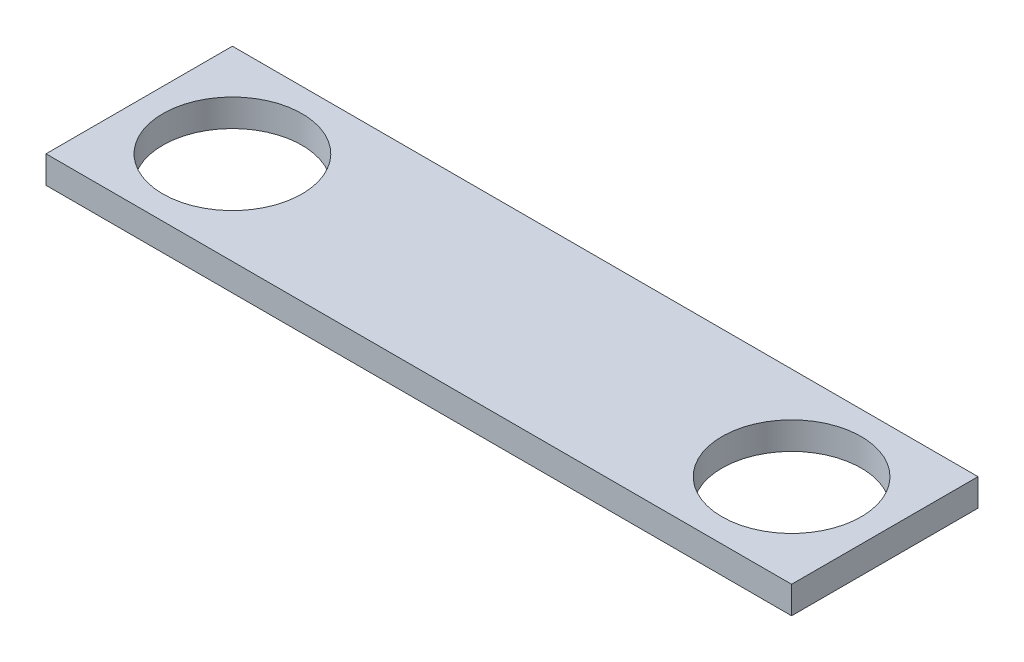
ISO-10303-21;
HEADER;
FILE_DESCRIPTION(('STEP AP214'),'2;1');
FILE_NAME('part.step','',(''),(''),'','','');
FILE_SCHEMA(('AUTOMOTIVE_DESIGN { 1 0 10303 214 1 1 1 1 }'));
ENDSEC;
DATA;
#1=APPLICATION_CONTEXT('core data for automotive mechanical design processes');
#2=APPLICATION_PROTOCOL_DEFINITION('international standard','automotive_design',2000,#1);
#3=PRODUCT_CONTEXT('',#1,'mechanical');
#4=PRODUCT('Part','Part','',(#3));
#5=PRODUCT_RELATED_PRODUCT_CATEGORY('part','',(#4));
#6=PRODUCT_DEFINITION_FORMATION('','',#4);
#7=PRODUCT_DEFINITION_CONTEXT('part definition',#1,'design');
#8=PRODUCT_DEFINITION('design','',#6,#7);
#9=PRODUCT_DEFINITION_SHAPE('','',#8);
#10=(LENGTH_UNIT() NAMED_UNIT(*) SI_UNIT(.MILLI.,.METRE.));
#11=(NAMED_UNIT(*) PLANE_ANGLE_UNIT() SI_UNIT($,.RADIAN.));
#12=(NAMED_UNIT(*) SI_UNIT($,.STERADIAN.) SOLID_ANGLE_UNIT());
#13=UNCERTAINTY_MEASURE_WITH_UNIT(LENGTH_MEASURE(1.E-05),#10,'distance_accuracy_value','');
#14=(GEOMETRIC_REPRESENTATION_CONTEXT(3) GLOBAL_UNCERTAINTY_ASSIGNED_CONTEXT((#13)) GLOBAL_UNIT_ASSIGNED_CONTEXT((#10,
#11,#12)) REPRESENTATION_CONTEXT('',''));
#15=CARTESIAN_POINT('',(0.,0.,0.));
#16=DIRECTION('',(0.,0.,1.));
#17=DIRECTION('',(1.,0.,0.));
#18=AXIS2_PLACEMENT_3D('',#15,#16,#17);
#19=CARTESIAN_POINT('',(0.,5.588,0.));
#20=DIRECTION('',(1.,0.,0.));
#21=DIRECTION('',(0.,0.,-1.));
#22=AXIS2_PLACEMENT_3D('',#19,#20,#21);
#23=PLANE('',#22);
#24=DIRECTION('',(0.,0.,1.));
#25=VECTOR('',#24,1.);
#26=CARTESIAN_POINT('',(0.,0.,0.));
#27=LINE('',#26,#25);
#28=CARTESIAN_POINT('',(0.,0.,-38.1));
#29=VERTEX_POINT('',#28);
#30=CARTESIAN_POINT('',(0.,0.,0.));
#31=VERTEX_POINT('',#30);
#32=EDGE_CURVE('E98',#29,#31,#27,.T.);
#33=ORIENTED_EDGE('',*,*,#32,.T.);
#34=DIRECTION('',(0.,-1.,0.));
#35=VECTOR('',#34,1.);
#36=CARTESIAN_POINT('',(0.,5.588,0.));
#37=LINE('',#36,#35);
#38=CARTESIAN_POINT('',(0.,5.588,0.));
#39=VERTEX_POINT('',#38);
#40=EDGE_CURVE('E11',#39,#31,#37,.T.);
#41=ORIENTED_EDGE('',*,*,#40,.F.);
#42=DIRECTION('',(0.,0.,1.));
#43=VECTOR('',#42,1.);
#44=CARTESIAN_POINT('',(0.,5.588,0.));
#45=LINE('',#44,#43);
#46=CARTESIAN_POINT('',(0.,5.588,-38.1));
#47=VERTEX_POINT('',#46);
#48=EDGE_CURVE('E86',#47,#39,#45,.T.);
#49=ORIENTED_EDGE('',*,*,#48,.F.);
#50=DIRECTION('',(0.,-1.,0.));
#51=VECTOR('',#50,1.);
#52=CARTESIAN_POINT('',(0.,5.588,-38.1));
#53=LINE('',#52,#51);
#54=EDGE_CURVE('E94',#47,#29,#53,.T.);
#55=ORIENTED_EDGE('',*,*,#54,.T.);
#56=EDGE_LOOP('',(#33,#41,#49,#55));
#57=FACE_BOUND('',#56,.T.);
#58=ADVANCED_FACE('F35',(#57),#23,.F.);
#59=CARTESIAN_POINT('',(0.,5.588,0.));
#60=DIRECTION('',(0.,0.,-1.));
#61=DIRECTION('',(-1.,0.,0.));
#62=AXIS2_PLACEMENT_3D('',#59,#60,#61);
#63=PLANE('',#62);
#64=DIRECTION('',(1.,0.,0.));
#65=VECTOR('',#64,1.);
#66=CARTESIAN_POINT('',(0.,0.,0.));
#67=LINE('',#66,#65);
#68=CARTESIAN_POINT('',(152.4,0.,0.));
#69=VERTEX_POINT('',#68);
#70=EDGE_CURVE('E90',#31,#69,#67,.T.);
#71=ORIENTED_EDGE('',*,*,#70,.T.);
#72=DIRECTION('',(0.,-1.,0.));
#73=VECTOR('',#72,1.);
#74=CARTESIAN_POINT('',(152.4,5.588,0.));
#75=LINE('',#74,#73);
#76=CARTESIAN_POINT('',(152.4,5.588,0.));
#77=VERTEX_POINT('',#76);
#78=EDGE_CURVE('E43',#77,#69,#75,.T.);
#79=ORIENTED_EDGE('',*,*,#78,.F.);
#80=DIRECTION('',(1.,0.,0.));
#81=VECTOR('',#80,1.);
#82=CARTESIAN_POINT('',(0.,5.588,0.));
#83=LINE('',#82,#81);
#84=EDGE_CURVE('E81',#39,#77,#83,.T.);
#85=ORIENTED_EDGE('',*,*,#84,.F.);
#86=ORIENTED_EDGE('',*,*,#40,.T.);
#87=EDGE_LOOP('',(#71,#79,#85,#86));
#88=FACE_BOUND('',#87,.T.);
#89=ADVANCED_FACE('F89',(#88),#63,.F.);
#90=CARTESIAN_POINT('',(152.4,5.588,0.));
#91=DIRECTION('',(-1.,0.,0.));
#92=DIRECTION('',(0.,0.,1.));
#93=AXIS2_PLACEMENT_3D('',#90,#91,#92);
#94=PLANE('',#93);
#95=DIRECTION('',(0.,0.,-1.));
#96=VECTOR('',#95,1.);
#97=CARTESIAN_POINT('',(152.4,0.,0.));
#98=LINE('',#97,#96);
#99=CARTESIAN_POINT('',(152.4,0.,-38.1));
#100=VERTEX_POINT('',#99);
#101=EDGE_CURVE('E68',#69,#100,#98,.T.);
#102=ORIENTED_EDGE('',*,*,#101,.T.);
#103=DIRECTION('',(0.,-1.,0.));
#104=VECTOR('',#103,1.);
#105=CARTESIAN_POINT('',(152.4,5.588,-38.1));
#106=LINE('',#105,#104);
#107=CARTESIAN_POINT('',(152.4,5.588,-38.1));
#108=VERTEX_POINT('',#107);
#109=EDGE_CURVE('E91',#108,#100,#106,.T.);
#110=ORIENTED_EDGE('',*,*,#109,.F.);
#111=DIRECTION('',(0.,0.,-1.));
#112=VECTOR('',#111,1.);
#113=CARTESIAN_POINT('',(152.4,5.588,0.));
#114=LINE('',#113,#112);
#115=EDGE_CURVE('E84',#77,#108,#114,.T.);
#116=ORIENTED_EDGE('',*,*,#115,.F.);
#117=ORIENTED_EDGE('',*,*,#78,.T.);
#118=EDGE_LOOP('',(#102,#110,#116,#117));
#119=FACE_BOUND('',#118,.T.);
#120=ADVANCED_FACE('F92',(#119),#94,.F.);
#121=CARTESIAN_POINT('',(0.,5.588,-38.1));
#122=DIRECTION('',(0.,0.,1.));
#123=DIRECTION('',(1.,0.,0.));
#124=AXIS2_PLACEMENT_3D('',#121,#122,#123);
#125=PLANE('',#124);
#126=DIRECTION('',(-1.,0.,0.));
#127=VECTOR('',#126,1.);
#128=CARTESIAN_POINT('',(0.,0.,-38.1));
#129=LINE('',#128,#127);
#130=EDGE_CURVE('E74',#100,#29,#129,.T.);
#131=ORIENTED_EDGE('',*,*,#130,.T.);
#132=ORIENTED_EDGE('',*,*,#54,.F.);
#133=DIRECTION('',(-1.,0.,0.));
#134=VECTOR('',#133,1.);
#135=CARTESIAN_POINT('',(0.,5.588,-38.1));
#136=LINE('',#135,#134);
#137=EDGE_CURVE('E51',#108,#47,#136,.T.);
#138=ORIENTED_EDGE('',*,*,#137,.F.);
#139=ORIENTED_EDGE('',*,*,#109,.T.);
#140=EDGE_LOOP('',(#131,#132,#138,#139));
#141=FACE_BOUND('',#140,.T.);
#142=ADVANCED_FACE('F106',(#141),#125,.F.);
#143=CARTESIAN_POINT('',(0.,5.588,0.));
#144=DIRECTION('',(0.,-1.,0.));
#145=DIRECTION('',(0.,0.,-1.));
#146=AXIS2_PLACEMENT_3D('',#143,#144,#145);
#147=PLANE('',#146);
#148=CARTESIAN_POINT('',(133.35,5.588,-19.05));
#149=DIRECTION('',(0.,1.,0.));
#150=DIRECTION('',(0.,0.,1.));
#151=AXIS2_PLACEMENT_3D('',#148,#149,#150);
#152=CIRCLE('',#151,14.224);
#153=CARTESIAN_POINT('',(133.35,5.588,-4.82599999999997));
#154=VERTEX_POINT('',#153);
#155=EDGE_CURVE('E118',#154,#154,#152,.T.);
#156=ORIENTED_EDGE('',*,*,#155,.F.);
#157=EDGE_LOOP('',(#156));
#158=FACE_BOUND('',#157,.T.);
#159=CARTESIAN_POINT('',(19.05,5.588,-19.05));
#160=DIRECTION('',(0.,1.,0.));
#161=DIRECTION('',(0.,0.,1.));
#162=AXIS2_PLACEMENT_3D('',#159,#160,#161);
#163=CIRCLE('',#162,14.224);
#164=CARTESIAN_POINT('',(19.05,5.588,-4.82600000000001));
#165=VERTEX_POINT('',#164);
#166=EDGE_CURVE('E112',#165,#165,#163,.T.);
#167=ORIENTED_EDGE('',*,*,#166,.F.);
#168=EDGE_LOOP('',(#167));
#169=FACE_BOUND('',#168,.T.);
#170=ORIENTED_EDGE('',*,*,#48,.T.);
#171=ORIENTED_EDGE('',*,*,#84,.T.);
#172=ORIENTED_EDGE('',*,*,#115,.T.);
#173=ORIENTED_EDGE('',*,*,#137,.T.);
#174=EDGE_LOOP('',(#170,#171,#172,#173));
#175=FACE_BOUND('',#174,.T.);
#176=ADVANCED_FACE('F82',(#158,#169,#175),#147,.F.);
#177=CARTESIAN_POINT('',(0.,0.,0.));
#178=DIRECTION('',(0.,-1.,0.));
#179=DIRECTION('',(0.,0.,-1.));
#180=AXIS2_PLACEMENT_3D('',#177,#178,#179);
#181=PLANE('',#180);
#182=CARTESIAN_POINT('',(133.35,0.,-19.05));
#183=DIRECTION('',(0.,1.,0.));
#184=DIRECTION('',(0.,0.,1.));
#185=AXIS2_PLACEMENT_3D('',#182,#183,#184);
#186=CIRCLE('',#185,14.224);
#187=CARTESIAN_POINT('',(133.35,0.,-4.82599999999997));
#188=VERTEX_POINT('',#187);
#189=EDGE_CURVE('E115',#188,#188,#186,.T.);
#190=ORIENTED_EDGE('',*,*,#189,.T.);
#191=EDGE_LOOP('',(#190));
#192=FACE_BOUND('',#191,.T.);
#193=CARTESIAN_POINT('',(19.05,0.,-19.05));
#194=DIRECTION('',(0.,1.,0.));
#195=DIRECTION('',(0.,0.,1.));
#196=AXIS2_PLACEMENT_3D('',#193,#194,#195);
#197=CIRCLE('',#196,14.224);
#198=CARTESIAN_POINT('',(19.05,0.,-4.82600000000001));
#199=VERTEX_POINT('',#198);
#200=EDGE_CURVE('E101',#199,#199,#197,.T.);
#201=ORIENTED_EDGE('',*,*,#200,.T.);
#202=EDGE_LOOP('',(#201));
#203=FACE_BOUND('',#202,.T.);
#204=ORIENTED_EDGE('',*,*,#32,.F.);
#205=ORIENTED_EDGE('',*,*,#130,.F.);
#206=ORIENTED_EDGE('',*,*,#101,.F.);
#207=ORIENTED_EDGE('',*,*,#70,.F.);
#208=EDGE_LOOP('',(#204,#205,#206,#207));
#209=FACE_BOUND('',#208,.T.);
#210=ADVANCED_FACE('F109',(#192,#203,#209),#181,.T.);
#211=CARTESIAN_POINT('',(19.05,0.,-19.05));
#212=DIRECTION('',(0.,1.,0.));
#213=DIRECTION('',(0.,0.,1.));
#214=AXIS2_PLACEMENT_3D('',#211,#212,#213);
#215=CYLINDRICAL_SURFACE('',#214,14.224);
#216=ORIENTED_EDGE('',*,*,#200,.F.);
#217=EDGE_LOOP('',(#216));
#218=FACE_BOUND('',#217,.T.);
#219=ORIENTED_EDGE('',*,*,#166,.T.);
#220=EDGE_LOOP('',(#219));
#221=FACE_BOUND('',#220,.T.);
#222=ADVANCED_FACE('F129',(#218,#221),#215,.F.);
#223=CARTESIAN_POINT('',(133.35,0.,-19.05));
#224=DIRECTION('',(0.,1.,0.));
#225=DIRECTION('',(0.,0.,1.));
#226=AXIS2_PLACEMENT_3D('',#223,#224,#225);
#227=CYLINDRICAL_SURFACE('',#226,14.224);
#228=ORIENTED_EDGE('',*,*,#189,.F.);
#229=EDGE_LOOP('',(#228));
#230=FACE_BOUND('',#229,.T.);
#231=ORIENTED_EDGE('',*,*,#155,.T.);
#232=EDGE_LOOP('',(#231));
#233=FACE_BOUND('',#232,.T.);
#234=ADVANCED_FACE('F126',(#230,#233),#227,.F.);
#235=CLOSED_SHELL('',(#58,#89,#120,#142,#176,#210,#222,#234));
#236=MANIFOLD_SOLID_BREP('B2',#235);
#237=ADVANCED_BREP_SHAPE_REPRESENTATION('',(#18,#236),#14);
#238=SHAPE_DEFINITION_REPRESENTATION(#9,#237);
ENDSEC;
END-ISO-10303-21;
